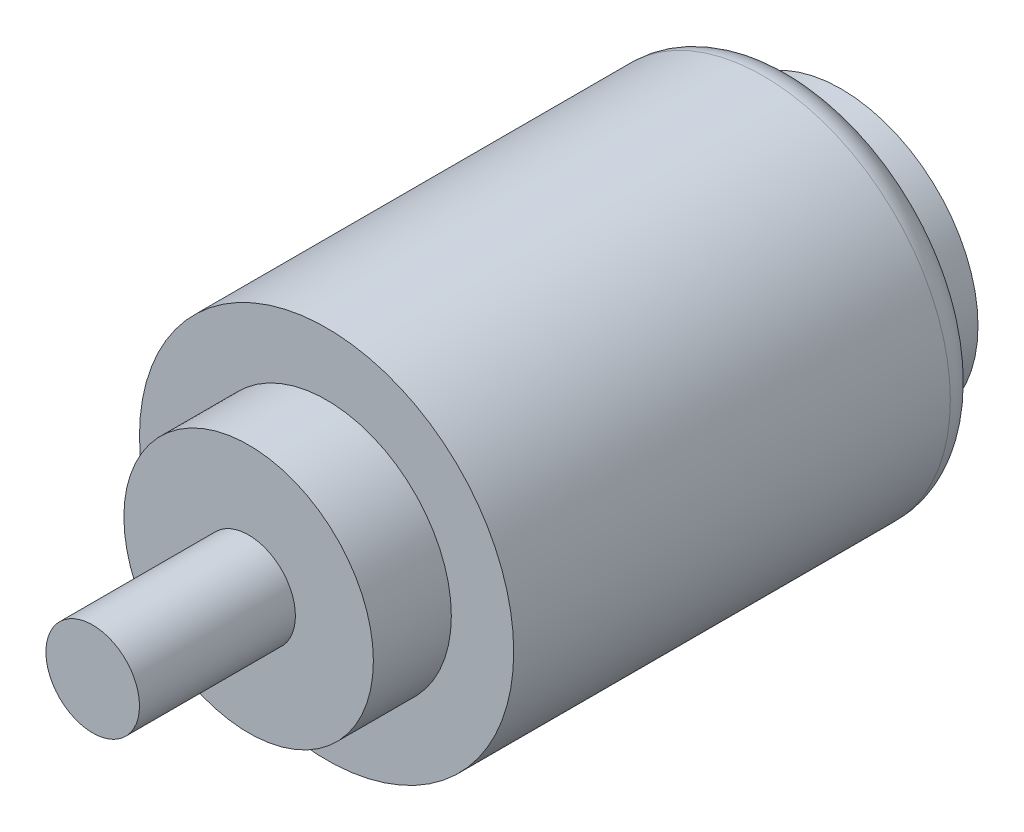
ISO-10303-21;
HEADER;
FILE_DESCRIPTION(('STEP AP214'),'2;1');
FILE_NAME('part.step','',(''),(''),'','','');
FILE_SCHEMA(('AUTOMOTIVE_DESIGN { 1 0 10303 214 1 1 1 1 }'));
ENDSEC;
DATA;
#1=APPLICATION_CONTEXT('core data for automotive mechanical design processes');
#2=APPLICATION_PROTOCOL_DEFINITION('international standard','automotive_design',2000,#1);
#3=PRODUCT_CONTEXT('',#1,'mechanical');
#4=PRODUCT('Part','Part','',(#3));
#5=PRODUCT_RELATED_PRODUCT_CATEGORY('part','',(#4));
#6=PRODUCT_DEFINITION_FORMATION('','',#4);
#7=PRODUCT_DEFINITION_CONTEXT('part definition',#1,'design');
#8=PRODUCT_DEFINITION('design','',#6,#7);
#9=PRODUCT_DEFINITION_SHAPE('','',#8);
#10=(LENGTH_UNIT() NAMED_UNIT(*) SI_UNIT(.MILLI.,.METRE.));
#11=(NAMED_UNIT(*) PLANE_ANGLE_UNIT() SI_UNIT($,.RADIAN.));
#12=(NAMED_UNIT(*) SI_UNIT($,.STERADIAN.) SOLID_ANGLE_UNIT());
#13=UNCERTAINTY_MEASURE_WITH_UNIT(LENGTH_MEASURE(1.E-05),#10,'distance_accuracy_value','');
#14=(GEOMETRIC_REPRESENTATION_CONTEXT(3) GLOBAL_UNCERTAINTY_ASSIGNED_CONTEXT((#13)) GLOBAL_UNIT_ASSIGNED_CONTEXT((#10,
#11,#12)) REPRESENTATION_CONTEXT('',''));
#15=CARTESIAN_POINT('',(0.,0.,0.));
#16=DIRECTION('',(0.,0.,1.));
#17=DIRECTION('',(1.,0.,0.));
#18=AXIS2_PLACEMENT_3D('',#15,#16,#17);
#19=CARTESIAN_POINT('',(5.17868932497556,-6.92509433962264,0.));
#20=DIRECTION('',(0.,0.,1.));
#21=DIRECTION('',(1.,0.,0.));
#22=AXIS2_PLACEMENT_3D('',#19,#20,#21);
#23=PLANE('',#22);
#24=CARTESIAN_POINT('',(5.17868932497556,-6.92509433962264,0.));
#25=DIRECTION('',(0.,0.,1.));
#26=DIRECTION('',(1.,0.,0.));
#27=AXIS2_PLACEMENT_3D('',#24,#25,#26);
#28=CIRCLE('',#27,10.);
#29=CARTESIAN_POINT('',(15.1786893249756,-6.92509433962264,0.));
#30=VERTEX_POINT('',#29);
#31=EDGE_CURVE('E10',#30,#30,#28,.F.);
#32=ORIENTED_EDGE('',*,*,#31,.T.);
#33=EDGE_LOOP('',(#32));
#34=FACE_BOUND('',#33,.T.);
#35=CARTESIAN_POINT('',(5.17868932497556,-6.92509433962264,0.));
#36=DIRECTION('',(0.,0.,1.));
#37=DIRECTION('',(1.,0.,0.));
#38=AXIS2_PLACEMENT_3D('',#35,#36,#37);
#39=CIRCLE('',#38,8.77398635086326);
#40=CARTESIAN_POINT('',(13.9526756758388,-6.92509433962264,0.));
#41=VERTEX_POINT('',#40);
#42=EDGE_CURVE('E44',#41,#41,#39,.F.);
#43=ORIENTED_EDGE('',*,*,#42,.F.);
#44=EDGE_LOOP('',(#43));
#45=FACE_BOUND('',#44,.T.);
#46=ADVANCED_FACE('F33',(#34,#45),#23,.F.);
#47=CARTESIAN_POINT('',(5.17868932497556,-6.92509433962264,35.));
#48=DIRECTION('',(0.,0.,1.));
#49=DIRECTION('',(1.,0.,0.));
#50=AXIS2_PLACEMENT_3D('',#47,#48,#49);
#51=PLANE('',#50);
#52=CARTESIAN_POINT('',(5.17868932497556,-6.92509433962264,35.));
#53=DIRECTION('',(0.,0.,1.));
#54=DIRECTION('',(1.,0.,0.));
#55=AXIS2_PLACEMENT_3D('',#52,#53,#54);
#56=CIRCLE('',#55,8.);
#57=CARTESIAN_POINT('',(13.1786893249756,-6.92509433962264,35.));
#58=VERTEX_POINT('',#57);
#59=EDGE_CURVE('E53',#58,#58,#56,.T.);
#60=ORIENTED_EDGE('',*,*,#59,.T.);
#61=EDGE_LOOP('',(#60));
#62=FACE_BOUND('',#61,.T.);
#63=CARTESIAN_POINT('',(5.17868932497556,-6.92509433962264,35.));
#64=DIRECTION('',(0.,0.,1.));
#65=DIRECTION('',(1.,0.,0.));
#66=AXIS2_PLACEMENT_3D('',#63,#64,#65);
#67=CIRCLE('',#66,3.);
#68=CARTESIAN_POINT('',(8.17868932497556,-6.92509433962264,35.));
#69=VERTEX_POINT('',#68);
#70=EDGE_CURVE('E60',#69,#69,#67,.T.);
#71=ORIENTED_EDGE('',*,*,#70,.F.);
#72=EDGE_LOOP('',(#71));
#73=FACE_BOUND('',#72,.T.);
#74=ADVANCED_FACE('F79',(#62,#73),#51,.T.);
#75=CARTESIAN_POINT('',(5.17868932497556,-6.92509433962264,30.));
#76=DIRECTION('',(0.,0.,1.));
#77=DIRECTION('',(1.,0.,0.));
#78=AXIS2_PLACEMENT_3D('',#75,#76,#77);
#79=PLANE('',#78);
#80=CARTESIAN_POINT('',(5.17868932497556,-6.92509433962264,30.));
#81=DIRECTION('',(0.,0.,1.));
#82=DIRECTION('',(1.,0.,0.));
#83=AXIS2_PLACEMENT_3D('',#80,#81,#82);
#84=CIRCLE('',#83,12.);
#85=CARTESIAN_POINT('',(17.1786893249756,-6.92509433962264,30.));
#86=VERTEX_POINT('',#85);
#87=EDGE_CURVE('E48',#86,#86,#84,.T.);
#88=ORIENTED_EDGE('',*,*,#87,.T.);
#89=EDGE_LOOP('',(#88));
#90=FACE_BOUND('',#89,.T.);
#91=CARTESIAN_POINT('',(5.17868932497556,-6.92509433962264,30.));
#92=DIRECTION('',(0.,0.,1.));
#93=DIRECTION('',(1.,0.,0.));
#94=AXIS2_PLACEMENT_3D('',#91,#92,#93);
#95=CIRCLE('',#94,8.);
#96=CARTESIAN_POINT('',(13.1786893249756,-6.92509433962264,30.));
#97=VERTEX_POINT('',#96);
#98=EDGE_CURVE('E54',#97,#97,#95,.T.);
#99=ORIENTED_EDGE('',*,*,#98,.F.);
#100=EDGE_LOOP('',(#99));
#101=FACE_BOUND('',#100,.T.);
#102=ADVANCED_FACE('F84',(#90,#101),#79,.T.);
#103=CARTESIAN_POINT('',(5.17868932497556,-6.92509433962264,30.));
#104=DIRECTION('',(0.,0.,-1.));
#105=DIRECTION('',(-1.,0.,0.));
#106=AXIS2_PLACEMENT_3D('',#103,#104,#105);
#107=CYLINDRICAL_SURFACE('',#106,12.);
#108=CARTESIAN_POINT('',(5.17868932497556,-6.92509433962264,2.));
#109=DIRECTION('',(0.,0.,1.));
#110=DIRECTION('',(1.,0.,0.));
#111=AXIS2_PLACEMENT_3D('',#108,#109,#110);
#112=CIRCLE('',#111,12.);
#113=CARTESIAN_POINT('',(17.1786893249756,-6.92509433962264,2.));
#114=VERTEX_POINT('',#113);
#115=EDGE_CURVE('E40',#114,#114,#112,.T.);
#116=ORIENTED_EDGE('',*,*,#115,.T.);
#117=EDGE_LOOP('',(#116));
#118=FACE_BOUND('',#117,.T.);
#119=ORIENTED_EDGE('',*,*,#87,.F.);
#120=EDGE_LOOP('',(#119));
#121=FACE_BOUND('',#120,.T.);
#122=ADVANCED_FACE('F89',(#118,#121),#107,.T.);
#123=CARTESIAN_POINT('',(5.17868932497556,-6.92509433962264,35.));
#124=DIRECTION('',(0.,0.,-1.));
#125=DIRECTION('',(-1.,0.,0.));
#126=AXIS2_PLACEMENT_3D('',#123,#124,#125);
#127=CYLINDRICAL_SURFACE('',#126,8.);
#128=ORIENTED_EDGE('',*,*,#59,.F.);
#129=EDGE_LOOP('',(#128));
#130=FACE_BOUND('',#129,.T.);
#131=ORIENTED_EDGE('',*,*,#98,.T.);
#132=EDGE_LOOP('',(#131));
#133=FACE_BOUND('',#132,.T.);
#134=ADVANCED_FACE('F91',(#130,#133),#127,.T.);
#135=CARTESIAN_POINT('',(5.17868932497556,-6.92509433962264,45.));
#136=DIRECTION('',(0.,0.,-1.));
#137=DIRECTION('',(-1.,0.,0.));
#138=AXIS2_PLACEMENT_3D('',#135,#136,#137);
#139=CYLINDRICAL_SURFACE('',#138,3.);
#140=CARTESIAN_POINT('',(5.17868932497556,-6.92509433962264,45.));
#141=DIRECTION('',(0.,0.,1.));
#142=DIRECTION('',(1.,0.,0.));
#143=AXIS2_PLACEMENT_3D('',#140,#141,#142);
#144=CIRCLE('',#143,3.);
#145=CARTESIAN_POINT('',(8.17868932497556,-6.92509433962264,45.));
#146=VERTEX_POINT('',#145);
#147=EDGE_CURVE('E57',#146,#146,#144,.T.);
#148=ORIENTED_EDGE('',*,*,#147,.F.);
#149=EDGE_LOOP('',(#148));
#150=FACE_BOUND('',#149,.T.);
#151=ORIENTED_EDGE('',*,*,#70,.T.);
#152=EDGE_LOOP('',(#151));
#153=FACE_BOUND('',#152,.T.);
#154=ADVANCED_FACE('F96',(#150,#153),#139,.T.);
#155=CARTESIAN_POINT('',(5.17868932497556,-6.92509433962264,45.));
#156=DIRECTION('',(0.,0.,1.));
#157=DIRECTION('',(1.,0.,0.));
#158=AXIS2_PLACEMENT_3D('',#155,#156,#157);
#159=PLANE('',#158);
#160=ORIENTED_EDGE('',*,*,#147,.T.);
#161=EDGE_LOOP('',(#160));
#162=FACE_BOUND('',#161,.T.);
#163=ADVANCED_FACE('F74',(#162),#159,.T.);
#164=CARTESIAN_POINT('',(5.17868932497556,-6.92509433962264,-3.));
#165=DIRECTION('',(0.,0.,1.));
#166=DIRECTION('',(1.,0.,0.));
#167=AXIS2_PLACEMENT_3D('',#164,#165,#166);
#168=CYLINDRICAL_SURFACE('',#167,8.77398635086326);
#169=CARTESIAN_POINT('',(5.17868932497556,-6.92509433962264,-3.));
#170=DIRECTION('',(0.,0.,-1.));
#171=DIRECTION('',(-1.,0.,0.));
#172=AXIS2_PLACEMENT_3D('',#169,#170,#171);
#173=CIRCLE('',#172,8.77398635086326);
#174=CARTESIAN_POINT('',(-3.5952970258877,-6.92509433962264,-3.));
#175=VERTEX_POINT('',#174);
#176=EDGE_CURVE('E63',#175,#175,#173,.T.);
#177=ORIENTED_EDGE('',*,*,#176,.F.);
#178=EDGE_LOOP('',(#177));
#179=FACE_BOUND('',#178,.T.);
#180=ORIENTED_EDGE('',*,*,#42,.T.);
#181=EDGE_LOOP('',(#180));
#182=FACE_BOUND('',#181,.T.);
#183=ADVANCED_FACE('F71',(#179,#182),#168,.T.);
#184=CARTESIAN_POINT('',(5.17868932497556,-6.92509433962264,-3.));
#185=DIRECTION('',(0.,0.,-1.));
#186=DIRECTION('',(-1.,0.,0.));
#187=AXIS2_PLACEMENT_3D('',#184,#185,#186);
#188=PLANE('',#187);
#189=ORIENTED_EDGE('',*,*,#176,.T.);
#190=EDGE_LOOP('',(#189));
#191=FACE_BOUND('',#190,.T.);
#192=ADVANCED_FACE('F69',(#191),#188,.T.);
#193=CARTESIAN_POINT('',(5.17868932497556,-6.92509433962264,2.));
#194=DIRECTION('',(0.,0.,1.));
#195=DIRECTION('',(1.,0.,0.));
#196=AXIS2_PLACEMENT_3D('',#193,#194,#195);
#197=TOROIDAL_SURFACE('',#196,10.,2.);
#198=ORIENTED_EDGE('',*,*,#31,.F.);
#199=EDGE_LOOP('',(#198));
#200=FACE_BOUND('',#199,.T.);
#201=ORIENTED_EDGE('',*,*,#115,.F.);
#202=EDGE_LOOP('',(#201));
#203=FACE_BOUND('',#202,.T.);
#204=ADVANCED_FACE('F35',(#200,#203),#197,.T.);
#205=CLOSED_SHELL('',(#46,#74,#102,#122,#134,#154,#163,#183,#192,#204));
#206=MANIFOLD_SOLID_BREP('B2',#205);
#207=ADVANCED_BREP_SHAPE_REPRESENTATION('',(#18,#206),#14);
#208=SHAPE_DEFINITION_REPRESENTATION(#9,#207);
ENDSEC;
END-ISO-10303-21;
